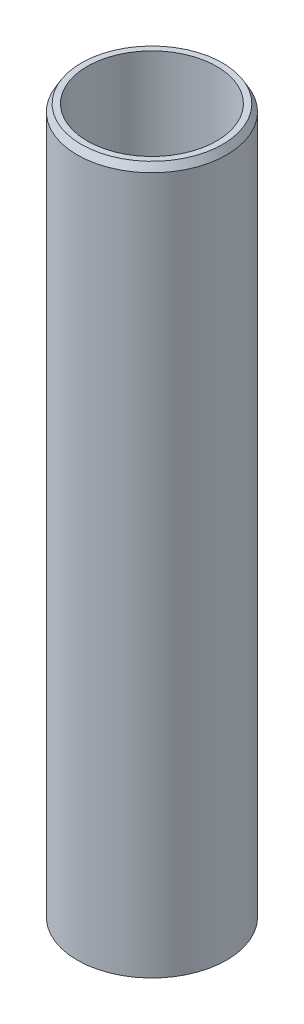
ISO-10303-21;
HEADER;
FILE_DESCRIPTION(('STEP AP214'),'2;1');
FILE_NAME('part.step','',(''),(''),'','','');
FILE_SCHEMA(('AUTOMOTIVE_DESIGN { 1 0 10303 214 1 1 1 1 }'));
ENDSEC;
DATA;
#1=APPLICATION_CONTEXT('core data for automotive mechanical design processes');
#2=APPLICATION_PROTOCOL_DEFINITION('international standard','automotive_design',2000,#1);
#3=PRODUCT_CONTEXT('',#1,'mechanical');
#4=PRODUCT('Part','Part','',(#3));
#5=PRODUCT_RELATED_PRODUCT_CATEGORY('part','',(#4));
#6=PRODUCT_DEFINITION_FORMATION('','',#4);
#7=PRODUCT_DEFINITION_CONTEXT('part definition',#1,'design');
#8=PRODUCT_DEFINITION('design','',#6,#7);
#9=PRODUCT_DEFINITION_SHAPE('','',#8);
#10=(LENGTH_UNIT() NAMED_UNIT(*) SI_UNIT(.MILLI.,.METRE.));
#11=(NAMED_UNIT(*) PLANE_ANGLE_UNIT() SI_UNIT($,.RADIAN.));
#12=(NAMED_UNIT(*) SI_UNIT($,.STERADIAN.) SOLID_ANGLE_UNIT());
#13=UNCERTAINTY_MEASURE_WITH_UNIT(LENGTH_MEASURE(1.E-05),#10,'distance_accuracy_value','');
#14=(GEOMETRIC_REPRESENTATION_CONTEXT(3) GLOBAL_UNCERTAINTY_ASSIGNED_CONTEXT((#13)) GLOBAL_UNIT_ASSIGNED_CONTEXT((#10,
#11,#12)) REPRESENTATION_CONTEXT('',''));
#15=CARTESIAN_POINT('',(0.,0.,0.));
#16=DIRECTION('',(0.,0.,1.));
#17=DIRECTION('',(1.,0.,0.));
#18=AXIS2_PLACEMENT_3D('',#15,#16,#17);
#19=CARTESIAN_POINT('',(0.,545.314212116955,0.));
#20=DIRECTION('',(0.,-1.,0.));
#21=DIRECTION('',(0.,0.,-1.));
#22=AXIS2_PLACEMENT_3D('',#19,#20,#21);
#23=CYLINDRICAL_SURFACE('',#22,57.5);
#24=CARTESIAN_POINT('',(0.,539.886186215316,0.));
#25=DIRECTION('',(0.,1.,0.));
#26=DIRECTION('',(0.,0.,1.));
#27=AXIS2_PLACEMENT_3D('',#24,#25,#26);
#28=CIRCLE('',#27,57.5);
#29=CARTESIAN_POINT('',(0.,539.886186215316,57.5));
#30=VERTEX_POINT('',#29);
#31=EDGE_CURVE('E50',#30,#30,#28,.F.);
#32=ORIENTED_EDGE('',*,*,#31,.T.);
#33=EDGE_LOOP('',(#32));
#34=FACE_BOUND('',#33,.T.);
#35=CARTESIAN_POINT('',(0.,3.13387221547901,0.));
#36=DIRECTION('',(0.,1.,0.));
#37=DIRECTION('',(0.,0.,1.));
#38=AXIS2_PLACEMENT_3D('',#35,#36,#37);
#39=CIRCLE('',#38,57.5);
#40=CARTESIAN_POINT('',(0.,3.13387221547901,57.5));
#41=VERTEX_POINT('',#40);
#42=EDGE_CURVE('E51',#41,#41,#39,.T.);
#43=ORIENTED_EDGE('',*,*,#42,.T.);
#44=EDGE_LOOP('',(#43));
#45=FACE_BOUND('',#44,.T.);
#46=ADVANCED_FACE('F39',(#34,#45),#23,.T.);
#47=CARTESIAN_POINT('',(0.,545.314212116955,0.));
#48=DIRECTION('',(0.,1.,0.));
#49=DIRECTION('',(0.,0.,1.));
#50=AXIS2_PLACEMENT_3D('',#47,#48,#49);
#51=PLANE('',#50);
#52=CARTESIAN_POINT('',(0.,545.314212116955,0.));
#53=DIRECTION('',(0.,1.,0.));
#54=DIRECTION('',(0.,0.,1.));
#55=AXIS2_PLACEMENT_3D('',#52,#53,#54);
#56=CIRCLE('',#55,54.3661277845207);
#57=CARTESIAN_POINT('',(0.,545.314212116955,54.3661277845207));
#58=VERTEX_POINT('',#57);
#59=EDGE_CURVE('E54',#58,#58,#56,.T.);
#60=ORIENTED_EDGE('',*,*,#59,.T.);
#61=EDGE_LOOP('',(#60));
#62=FACE_BOUND('',#61,.T.);
#63=CARTESIAN_POINT('',(0.,545.314212116955,0.));
#64=DIRECTION('',(0.,1.,0.));
#65=DIRECTION('',(0.,0.,1.));
#66=AXIS2_PLACEMENT_3D('',#63,#64,#65);
#67=CIRCLE('',#66,49.79923124727);
#68=CARTESIAN_POINT('',(0.,545.314212116955,49.79923124727));
#69=VERTEX_POINT('',#68);
#70=EDGE_CURVE('E58',#69,#69,#67,.T.);
#71=ORIENTED_EDGE('',*,*,#70,.F.);
#72=EDGE_LOOP('',(#71));
#73=FACE_BOUND('',#72,.T.);
#74=ADVANCED_FACE('F69',(#62,#73),#51,.T.);
#75=CARTESIAN_POINT('',(0.,0.,0.));
#76=DIRECTION('',(0.,1.,0.));
#77=DIRECTION('',(0.,0.,1.));
#78=AXIS2_PLACEMENT_3D('',#75,#76,#77);
#79=PLANE('',#78);
#80=CARTESIAN_POINT('',(0.,0.,0.));
#81=DIRECTION('',(0.,1.,0.));
#82=DIRECTION('',(0.,0.,1.));
#83=AXIS2_PLACEMENT_3D('',#80,#81,#82);
#84=CIRCLE('',#83,52.0719740983619);
#85=CARTESIAN_POINT('',(0.,0.,52.0719740983619));
#86=VERTEX_POINT('',#85);
#87=EDGE_CURVE('E10',#86,#86,#84,.F.);
#88=ORIENTED_EDGE('',*,*,#87,.T.);
#89=EDGE_LOOP('',(#88));
#90=FACE_BOUND('',#89,.T.);
#91=CARTESIAN_POINT('',(0.,0.,0.));
#92=DIRECTION('',(0.,1.,0.));
#93=DIRECTION('',(0.,0.,1.));
#94=AXIS2_PLACEMENT_3D('',#91,#92,#93);
#95=CIRCLE('',#94,49.79923124727);
#96=CARTESIAN_POINT('',(0.,0.,49.79923124727));
#97=VERTEX_POINT('',#96);
#98=EDGE_CURVE('E63',#97,#97,#95,.T.);
#99=ORIENTED_EDGE('',*,*,#98,.T.);
#100=EDGE_LOOP('',(#99));
#101=FACE_BOUND('',#100,.T.);
#102=ADVANCED_FACE('F75',(#90,#101),#79,.F.);
#103=CARTESIAN_POINT('',(0.,545.314212116955,0.));
#104=DIRECTION('',(0.,-1.,0.));
#105=DIRECTION('',(0.,0.,-1.));
#106=AXIS2_PLACEMENT_3D('',#103,#104,#105);
#107=CYLINDRICAL_SURFACE('',#106,49.79923124727);
#108=ORIENTED_EDGE('',*,*,#70,.T.);
#109=EDGE_LOOP('',(#108));
#110=FACE_BOUND('',#109,.T.);
#111=ORIENTED_EDGE('',*,*,#98,.F.);
#112=EDGE_LOOP('',(#111));
#113=FACE_BOUND('',#112,.T.);
#114=ADVANCED_FACE('F70',(#110,#113),#107,.F.);
#115=CARTESIAN_POINT('',(0.,545.314212116955,0.));
#116=DIRECTION('',(0.,-1.,0.));
#117=DIRECTION('',(0.,0.,-1.));
#118=AXIS2_PLACEMENT_3D('',#115,#116,#117);
#119=CONICAL_SURFACE('',#118,54.3661277845207,0.523598775598297);
#120=ORIENTED_EDGE('',*,*,#31,.F.);
#121=EDGE_LOOP('',(#120));
#122=FACE_BOUND('',#121,.T.);
#123=ORIENTED_EDGE('',*,*,#59,.F.);
#124=EDGE_LOOP('',(#123));
#125=FACE_BOUND('',#124,.T.);
#126=ADVANCED_FACE('F81',(#122,#125),#119,.T.);
#127=CARTESIAN_POINT('',(0.,3.13387221547901,0.));
#128=DIRECTION('',(0.,1.,0.));
#129=DIRECTION('',(0.,0.,1.));
#130=AXIS2_PLACEMENT_3D('',#127,#128,#129);
#131=CONICAL_SURFACE('',#130,57.5,1.0471975511966);
#132=ORIENTED_EDGE('',*,*,#87,.F.);
#133=EDGE_LOOP('',(#132));
#134=FACE_BOUND('',#133,.T.);
#135=ORIENTED_EDGE('',*,*,#42,.F.);
#136=EDGE_LOOP('',(#135));
#137=FACE_BOUND('',#136,.T.);
#138=ADVANCED_FACE('F45',(#134,#137),#131,.T.);
#139=CLOSED_SHELL('',(#46,#74,#102,#114,#126,#138));
#140=MANIFOLD_SOLID_BREP('B2',#139);
#141=ADVANCED_BREP_SHAPE_REPRESENTATION('',(#18,#140),#14);
#142=SHAPE_DEFINITION_REPRESENTATION(#9,#141);
ENDSEC;
END-ISO-10303-21;
